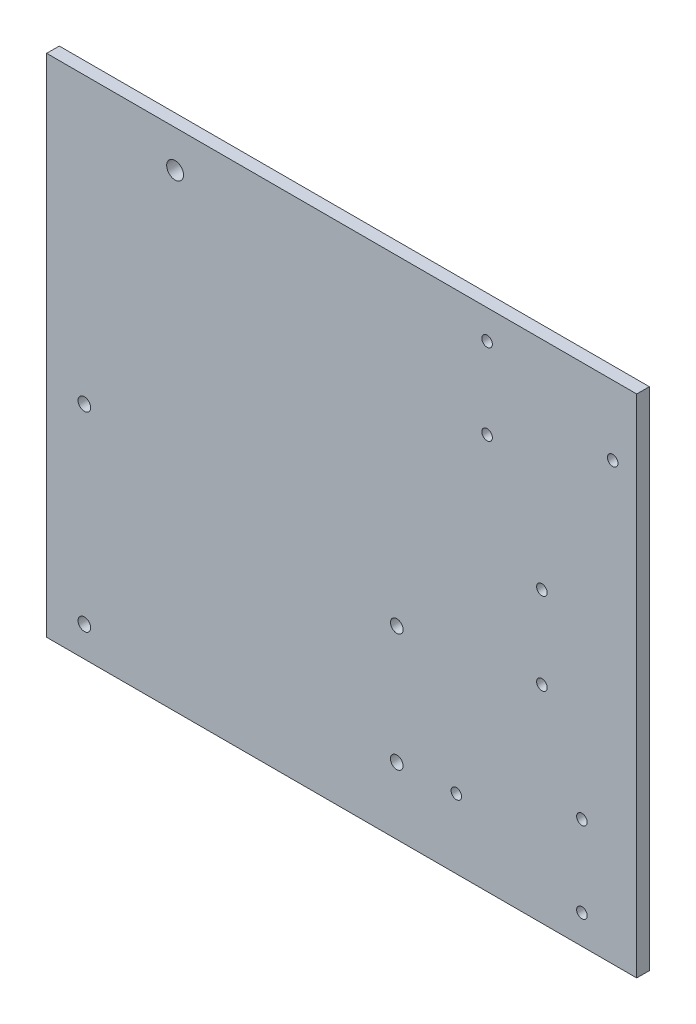
ISO-10303-21;
HEADER;
FILE_DESCRIPTION(('STEP AP214'),'2;1');
FILE_NAME('part.step','',(''),(''),'','','');
FILE_SCHEMA(('AUTOMOTIVE_DESIGN { 1 0 10303 214 1 1 1 1 }'));
ENDSEC;
DATA;
#1=APPLICATION_CONTEXT('core data for automotive mechanical design processes');
#2=APPLICATION_PROTOCOL_DEFINITION('international standard','automotive_design',2000,#1);
#3=PRODUCT_CONTEXT('',#1,'mechanical');
#4=PRODUCT('Part','Part','',(#3));
#5=PRODUCT_RELATED_PRODUCT_CATEGORY('part','',(#4));
#6=PRODUCT_DEFINITION_FORMATION('','',#4);
#7=PRODUCT_DEFINITION_CONTEXT('part definition',#1,'design');
#8=PRODUCT_DEFINITION('design','',#6,#7);
#9=PRODUCT_DEFINITION_SHAPE('','',#8);
#10=(LENGTH_UNIT() NAMED_UNIT(*) SI_UNIT(.MILLI.,.METRE.));
#11=(NAMED_UNIT(*) PLANE_ANGLE_UNIT() SI_UNIT($,.RADIAN.));
#12=(NAMED_UNIT(*) SI_UNIT($,.STERADIAN.) SOLID_ANGLE_UNIT());
#13=UNCERTAINTY_MEASURE_WITH_UNIT(LENGTH_MEASURE(1.E-05),#10,'distance_accuracy_value','');
#14=(GEOMETRIC_REPRESENTATION_CONTEXT(3) GLOBAL_UNCERTAINTY_ASSIGNED_CONTEXT((#13)) GLOBAL_UNIT_ASSIGNED_CONTEXT((#10,
#11,#12)) REPRESENTATION_CONTEXT('',''));
#15=CARTESIAN_POINT('',(0.,0.,0.));
#16=DIRECTION('',(0.,0.,1.));
#17=DIRECTION('',(1.,0.,0.));
#18=AXIS2_PLACEMENT_3D('',#15,#16,#17);
#19=CARTESIAN_POINT('',(0.,0.,3.));
#20=DIRECTION('',(0.,0.,1.));
#21=DIRECTION('',(1.,0.,0.));
#22=AXIS2_PLACEMENT_3D('',#19,#20,#21);
#23=PLANE('',#22);
#24=CARTESIAN_POINT('',(-42.8,16.5,3.));
#25=DIRECTION('',(0.,0.,1.));
#26=DIRECTION('',(-1.,0.,0.));
#27=AXIS2_PLACEMENT_3D('',#24,#25,#26);
#28=CIRCLE('',#27,1.25);
#29=CARTESIAN_POINT('',(-44.05,16.5,3.));
#30=VERTEX_POINT('',#29);
#31=EDGE_CURVE('E175',#30,#30,#28,.T.);
#32=ORIENTED_EDGE('',*,*,#31,.F.);
#33=EDGE_LOOP('',(#32));
#34=FACE_BOUND('',#33,.T.);
#35=CARTESIAN_POINT('',(-13.,26.11,3.));
#36=DIRECTION('',(0.,0.,1.));
#37=DIRECTION('',(-1.,0.,0.));
#38=AXIS2_PLACEMENT_3D('',#35,#36,#37);
#39=CIRCLE('',#38,1.25);
#40=CARTESIAN_POINT('',(-14.25,26.11,3.));
#41=VERTEX_POINT('',#40);
#42=EDGE_CURVE('E163',#41,#41,#39,.T.);
#43=ORIENTED_EDGE('',*,*,#42,.F.);
#44=EDGE_LOOP('',(#43));
#45=FACE_BOUND('',#44,.T.);
#46=CARTESIAN_POINT('',(-5.7,103.5,3.));
#47=DIRECTION('',(0.,0.,1.));
#48=DIRECTION('',(-1.,0.,0.));
#49=AXIS2_PLACEMENT_3D('',#46,#47,#48);
#50=CIRCLE('',#49,1.25000000000001);
#51=CARTESIAN_POINT('',(-6.95000000000001,103.5,3.));
#52=VERTEX_POINT('',#51);
#53=EDGE_CURVE('E151',#52,#52,#50,.T.);
#54=ORIENTED_EDGE('',*,*,#53,.F.);
#55=EDGE_LOOP('',(#54));
#56=FACE_BOUND('',#55,.T.);
#57=CARTESIAN_POINT('',(-35.5,113.09,3.));
#58=DIRECTION('',(0.,0.,1.));
#59=DIRECTION('',(-1.,0.,0.));
#60=AXIS2_PLACEMENT_3D('',#57,#58,#59);
#61=CIRCLE('',#60,1.25);
#62=CARTESIAN_POINT('',(-36.75,113.09,3.));
#63=VERTEX_POINT('',#62);
#64=EDGE_CURVE('E139',#63,#63,#61,.T.);
#65=ORIENTED_EDGE('',*,*,#64,.F.);
#66=EDGE_LOOP('',(#65));
#67=FACE_BOUND('',#66,.T.);
#68=CARTESIAN_POINT('',(-35.5,93.89,3.));
#69=DIRECTION('',(0.,0.,1.));
#70=DIRECTION('',(-1.,0.,0.));
#71=AXIS2_PLACEMENT_3D('',#68,#69,#70);
#72=CIRCLE('',#71,1.25);
#73=CARTESIAN_POINT('',(-36.75,93.89,3.));
#74=VERTEX_POINT('',#73);
#75=EDGE_CURVE('E127',#74,#74,#72,.T.);
#76=ORIENTED_EDGE('',*,*,#75,.F.);
#77=EDGE_LOOP('',(#76));
#78=FACE_BOUND('',#77,.T.);
#79=CARTESIAN_POINT('',(-131.05,52.4100000000001,3.));
#80=DIRECTION('',(0.,0.,1.));
#81=DIRECTION('',(-1.,0.,0.));
#82=AXIS2_PLACEMENT_3D('',#79,#80,#81);
#83=CIRCLE('',#82,1.5);
#84=CARTESIAN_POINT('',(-132.55,52.4100000000001,3.));
#85=VERTEX_POINT('',#84);
#86=EDGE_CURVE('E115',#85,#85,#83,.T.);
#87=ORIENTED_EDGE('',*,*,#86,.F.);
#88=EDGE_LOOP('',(#87));
#89=FACE_BOUND('',#88,.T.);
#90=DIRECTION('',(0.,1.,0.));
#91=VECTOR('',#90,1.);
#92=CARTESIAN_POINT('',(0.,0.,3.));
#93=LINE('',#92,#91);
#94=CARTESIAN_POINT('',(0.,0.,3.));
#95=VERTEX_POINT('',#94);
#96=CARTESIAN_POINT('',(0.,120.,3.));
#97=VERTEX_POINT('',#96);
#98=EDGE_CURVE('E85',#95,#97,#93,.T.);
#99=ORIENTED_EDGE('',*,*,#98,.T.);
#100=DIRECTION('',(-1.,0.,0.));
#101=VECTOR('',#100,1.);
#102=CARTESIAN_POINT('',(0.,120.,3.));
#103=LINE('',#102,#101);
#104=CARTESIAN_POINT('',(-140.,120.,3.));
#105=VERTEX_POINT('',#104);
#106=EDGE_CURVE('E80',#97,#105,#103,.T.);
#107=ORIENTED_EDGE('',*,*,#106,.T.);
#108=DIRECTION('',(0.,-1.,0.));
#109=VECTOR('',#108,1.);
#110=CARTESIAN_POINT('',(-140.,0.,3.));
#111=LINE('',#110,#109);
#112=CARTESIAN_POINT('',(-140.,0.,3.));
#113=VERTEX_POINT('',#112);
#114=EDGE_CURVE('E83',#105,#113,#111,.T.);
#115=ORIENTED_EDGE('',*,*,#114,.T.);
#116=DIRECTION('',(1.,0.,0.));
#117=VECTOR('',#116,1.);
#118=CARTESIAN_POINT('',(0.,0.,3.));
#119=LINE('',#118,#117);
#120=EDGE_CURVE('E50',#113,#95,#119,.T.);
#121=ORIENTED_EDGE('',*,*,#120,.T.);
#122=EDGE_LOOP('',(#99,#107,#115,#121));
#123=FACE_BOUND('',#122,.T.);
#124=CARTESIAN_POINT('',(-109.522973193563,111.205068666322,3.));
#125=DIRECTION('',(0.,0.,1.));
#126=DIRECTION('',(1.,0.,0.));
#127=AXIS2_PLACEMENT_3D('',#124,#125,#126);
#128=CIRCLE('',#127,2.);
#129=CARTESIAN_POINT('',(-107.522973193563,111.205068666322,3.));
#130=VERTEX_POINT('',#129);
#131=EDGE_CURVE('E100',#130,#130,#128,.T.);
#132=ORIENTED_EDGE('',*,*,#131,.F.);
#133=EDGE_LOOP('',(#132));
#134=FACE_BOUND('',#133,.T.);
#135=CARTESIAN_POINT('',(-131.05,7.17000000000005,3.));
#136=DIRECTION('',(0.,0.,1.));
#137=DIRECTION('',(-1.,0.,0.));
#138=AXIS2_PLACEMENT_3D('',#135,#136,#137);
#139=CIRCLE('',#138,1.5);
#140=CARTESIAN_POINT('',(-132.55,7.17000000000005,3.));
#141=VERTEX_POINT('',#140);
#142=EDGE_CURVE('E121',#141,#141,#139,.T.);
#143=ORIENTED_EDGE('',*,*,#142,.F.);
#144=EDGE_LOOP('',(#143));
#145=FACE_BOUND('',#144,.T.);
#146=CARTESIAN_POINT('',(-56.93,15.86,3.));
#147=DIRECTION('',(0.,0.,1.));
#148=DIRECTION('',(-1.,0.,0.));
#149=AXIS2_PLACEMENT_3D('',#146,#147,#148);
#150=CIRCLE('',#149,1.5);
#151=CARTESIAN_POINT('',(-58.43,15.86,3.));
#152=VERTEX_POINT('',#151);
#153=EDGE_CURVE('E133',#152,#152,#150,.T.);
#154=ORIENTED_EDGE('',*,*,#153,.F.);
#155=EDGE_LOOP('',(#154));
#156=FACE_BOUND('',#155,.T.);
#157=CARTESIAN_POINT('',(-56.93,43.86,3.));
#158=DIRECTION('',(0.,0.,1.));
#159=DIRECTION('',(-1.,0.,0.));
#160=AXIS2_PLACEMENT_3D('',#157,#158,#159);
#161=CIRCLE('',#160,1.5);
#162=CARTESIAN_POINT('',(-58.43,43.86,3.));
#163=VERTEX_POINT('',#162);
#164=EDGE_CURVE('E145',#163,#163,#161,.T.);
#165=ORIENTED_EDGE('',*,*,#164,.F.);
#166=EDGE_LOOP('',(#165));
#167=FACE_BOUND('',#166,.T.);
#168=CARTESIAN_POINT('',(-13.,6.91,3.));
#169=DIRECTION('',(0.,0.,1.));
#170=DIRECTION('',(-1.,0.,0.));
#171=AXIS2_PLACEMENT_3D('',#168,#169,#170);
#172=CIRCLE('',#171,1.25);
#173=CARTESIAN_POINT('',(-14.25,6.91,3.));
#174=VERTEX_POINT('',#173);
#175=EDGE_CURVE('E157',#174,#174,#172,.T.);
#176=ORIENTED_EDGE('',*,*,#175,.F.);
#177=EDGE_LOOP('',(#176));
#178=FACE_BOUND('',#177,.T.);
#179=CARTESIAN_POINT('',(-22.5,49.0276262940552,3.));
#180=DIRECTION('',(0.,0.,1.));
#181=DIRECTION('',(1.,0.,0.));
#182=AXIS2_PLACEMENT_3D('',#179,#180,#181);
#183=CIRCLE('',#182,1.25);
#184=CARTESIAN_POINT('',(-21.25,49.0276262940552,3.));
#185=VERTEX_POINT('',#184);
#186=EDGE_CURVE('E169',#185,#185,#183,.T.);
#187=ORIENTED_EDGE('',*,*,#186,.F.);
#188=EDGE_LOOP('',(#187));
#189=FACE_BOUND('',#188,.T.);
#190=CARTESIAN_POINT('',(-22.5,68.5276262940552,3.));
#191=DIRECTION('',(0.,0.,1.));
#192=DIRECTION('',(1.,0.,0.));
#193=AXIS2_PLACEMENT_3D('',#190,#191,#192);
#194=CIRCLE('',#193,1.25);
#195=CARTESIAN_POINT('',(-21.25,68.5276262940552,3.));
#196=VERTEX_POINT('',#195);
#197=EDGE_CURVE('E181',#196,#196,#194,.T.);
#198=ORIENTED_EDGE('',*,*,#197,.F.);
#199=EDGE_LOOP('',(#198));
#200=FACE_BOUND('',#199,.T.);
#201=ADVANCED_FACE('F33',(#34,#45,#56,#67,#78,#89,#123,#134,#145,#156,#167,#178,#189,#200),#23,.T.);
#202=CARTESIAN_POINT('',(0.,0.,0.));
#203=DIRECTION('',(0.,0.,1.));
#204=DIRECTION('',(1.,0.,0.));
#205=AXIS2_PLACEMENT_3D('',#202,#203,#204);
#206=PLANE('',#205);
#207=DIRECTION('',(0.,1.,0.));
#208=VECTOR('',#207,1.);
#209=CARTESIAN_POINT('',(0.,0.,0.));
#210=LINE('',#209,#208);
#211=CARTESIAN_POINT('',(0.,0.,0.));
#212=VERTEX_POINT('',#211);
#213=CARTESIAN_POINT('',(0.,120.,0.));
#214=VERTEX_POINT('',#213);
#215=EDGE_CURVE('E97',#212,#214,#210,.T.);
#216=ORIENTED_EDGE('',*,*,#215,.F.);
#217=DIRECTION('',(1.,0.,0.));
#218=VECTOR('',#217,1.);
#219=CARTESIAN_POINT('',(0.,0.,0.));
#220=LINE('',#219,#218);
#221=CARTESIAN_POINT('',(-140.,0.,0.));
#222=VERTEX_POINT('',#221);
#223=EDGE_CURVE('E73',#222,#212,#220,.T.);
#224=ORIENTED_EDGE('',*,*,#223,.F.);
#225=DIRECTION('',(0.,-1.,0.));
#226=VECTOR('',#225,1.);
#227=CARTESIAN_POINT('',(-140.,0.,0.));
#228=LINE('',#227,#226);
#229=CARTESIAN_POINT('',(-140.,120.,0.));
#230=VERTEX_POINT('',#229);
#231=EDGE_CURVE('E67',#230,#222,#228,.T.);
#232=ORIENTED_EDGE('',*,*,#231,.F.);
#233=DIRECTION('',(-1.,0.,0.));
#234=VECTOR('',#233,1.);
#235=CARTESIAN_POINT('',(0.,120.,0.));
#236=LINE('',#235,#234);
#237=EDGE_CURVE('E89',#214,#230,#236,.T.);
#238=ORIENTED_EDGE('',*,*,#237,.F.);
#239=EDGE_LOOP('',(#216,#224,#232,#238));
#240=FACE_BOUND('',#239,.T.);
#241=CARTESIAN_POINT('',(-109.522973193563,111.205068666322,0.));
#242=DIRECTION('',(0.,0.,1.));
#243=DIRECTION('',(1.,0.,0.));
#244=AXIS2_PLACEMENT_3D('',#241,#242,#243);
#245=CIRCLE('',#244,2.);
#246=CARTESIAN_POINT('',(-107.522973193563,111.205068666322,0.));
#247=VERTEX_POINT('',#246);
#248=EDGE_CURVE('E112',#247,#247,#245,.T.);
#249=ORIENTED_EDGE('',*,*,#248,.T.);
#250=EDGE_LOOP('',(#249));
#251=FACE_BOUND('',#250,.T.);
#252=CARTESIAN_POINT('',(-131.05,52.4100000000001,0.));
#253=DIRECTION('',(0.,0.,1.));
#254=DIRECTION('',(-1.,0.,0.));
#255=AXIS2_PLACEMENT_3D('',#252,#253,#254);
#256=CIRCLE('',#255,1.5);
#257=CARTESIAN_POINT('',(-132.55,52.4100000000001,0.));
#258=VERTEX_POINT('',#257);
#259=EDGE_CURVE('E118',#258,#258,#256,.T.);
#260=ORIENTED_EDGE('',*,*,#259,.T.);
#261=EDGE_LOOP('',(#260));
#262=FACE_BOUND('',#261,.T.);
#263=CARTESIAN_POINT('',(-131.05,7.17000000000005,0.));
#264=DIRECTION('',(0.,0.,1.));
#265=DIRECTION('',(-1.,0.,0.));
#266=AXIS2_PLACEMENT_3D('',#263,#264,#265);
#267=CIRCLE('',#266,1.5);
#268=CARTESIAN_POINT('',(-132.55,7.17000000000005,0.));
#269=VERTEX_POINT('',#268);
#270=EDGE_CURVE('E124',#269,#269,#267,.T.);
#271=ORIENTED_EDGE('',*,*,#270,.T.);
#272=EDGE_LOOP('',(#271));
#273=FACE_BOUND('',#272,.T.);
#274=CARTESIAN_POINT('',(-35.5,93.89,0.));
#275=DIRECTION('',(0.,0.,1.));
#276=DIRECTION('',(-1.,0.,0.));
#277=AXIS2_PLACEMENT_3D('',#274,#275,#276);
#278=CIRCLE('',#277,1.25);
#279=CARTESIAN_POINT('',(-36.75,93.89,0.));
#280=VERTEX_POINT('',#279);
#281=EDGE_CURVE('E130',#280,#280,#278,.T.);
#282=ORIENTED_EDGE('',*,*,#281,.T.);
#283=EDGE_LOOP('',(#282));
#284=FACE_BOUND('',#283,.T.);
#285=CARTESIAN_POINT('',(-56.93,15.86,0.));
#286=DIRECTION('',(0.,0.,1.));
#287=DIRECTION('',(-1.,0.,0.));
#288=AXIS2_PLACEMENT_3D('',#285,#286,#287);
#289=CIRCLE('',#288,1.5);
#290=CARTESIAN_POINT('',(-58.43,15.86,0.));
#291=VERTEX_POINT('',#290);
#292=EDGE_CURVE('E136',#291,#291,#289,.T.);
#293=ORIENTED_EDGE('',*,*,#292,.T.);
#294=EDGE_LOOP('',(#293));
#295=FACE_BOUND('',#294,.T.);
#296=CARTESIAN_POINT('',(-35.5,113.09,0.));
#297=DIRECTION('',(0.,0.,1.));
#298=DIRECTION('',(-1.,0.,0.));
#299=AXIS2_PLACEMENT_3D('',#296,#297,#298);
#300=CIRCLE('',#299,1.25);
#301=CARTESIAN_POINT('',(-36.75,113.09,0.));
#302=VERTEX_POINT('',#301);
#303=EDGE_CURVE('E142',#302,#302,#300,.T.);
#304=ORIENTED_EDGE('',*,*,#303,.T.);
#305=EDGE_LOOP('',(#304));
#306=FACE_BOUND('',#305,.T.);
#307=CARTESIAN_POINT('',(-56.93,43.86,0.));
#308=DIRECTION('',(0.,0.,1.));
#309=DIRECTION('',(-1.,0.,0.));
#310=AXIS2_PLACEMENT_3D('',#307,#308,#309);
#311=CIRCLE('',#310,1.5);
#312=CARTESIAN_POINT('',(-58.43,43.86,0.));
#313=VERTEX_POINT('',#312);
#314=EDGE_CURVE('E148',#313,#313,#311,.T.);
#315=ORIENTED_EDGE('',*,*,#314,.T.);
#316=EDGE_LOOP('',(#315));
#317=FACE_BOUND('',#316,.T.);
#318=CARTESIAN_POINT('',(-5.7,103.5,0.));
#319=DIRECTION('',(0.,0.,1.));
#320=DIRECTION('',(-1.,0.,0.));
#321=AXIS2_PLACEMENT_3D('',#318,#319,#320);
#322=CIRCLE('',#321,1.25000000000001);
#323=CARTESIAN_POINT('',(-6.95000000000001,103.5,0.));
#324=VERTEX_POINT('',#323);
#325=EDGE_CURVE('E154',#324,#324,#322,.T.);
#326=ORIENTED_EDGE('',*,*,#325,.T.);
#327=EDGE_LOOP('',(#326));
#328=FACE_BOUND('',#327,.T.);
#329=CARTESIAN_POINT('',(-13.,6.91,0.));
#330=DIRECTION('',(0.,0.,1.));
#331=DIRECTION('',(-1.,0.,0.));
#332=AXIS2_PLACEMENT_3D('',#329,#330,#331);
#333=CIRCLE('',#332,1.25);
#334=CARTESIAN_POINT('',(-14.25,6.91,0.));
#335=VERTEX_POINT('',#334);
#336=EDGE_CURVE('E160',#335,#335,#333,.T.);
#337=ORIENTED_EDGE('',*,*,#336,.T.);
#338=EDGE_LOOP('',(#337));
#339=FACE_BOUND('',#338,.T.);
#340=CARTESIAN_POINT('',(-13.,26.11,0.));
#341=DIRECTION('',(0.,0.,1.));
#342=DIRECTION('',(-1.,0.,0.));
#343=AXIS2_PLACEMENT_3D('',#340,#341,#342);
#344=CIRCLE('',#343,1.25);
#345=CARTESIAN_POINT('',(-14.25,26.11,0.));
#346=VERTEX_POINT('',#345);
#347=EDGE_CURVE('E166',#346,#346,#344,.T.);
#348=ORIENTED_EDGE('',*,*,#347,.T.);
#349=EDGE_LOOP('',(#348));
#350=FACE_BOUND('',#349,.T.);
#351=CARTESIAN_POINT('',(-22.5,49.0276262940552,0.));
#352=DIRECTION('',(0.,0.,1.));
#353=DIRECTION('',(1.,0.,0.));
#354=AXIS2_PLACEMENT_3D('',#351,#352,#353);
#355=CIRCLE('',#354,1.25);
#356=CARTESIAN_POINT('',(-21.25,49.0276262940552,0.));
#357=VERTEX_POINT('',#356);
#358=EDGE_CURVE('E172',#357,#357,#355,.T.);
#359=ORIENTED_EDGE('',*,*,#358,.T.);
#360=EDGE_LOOP('',(#359));
#361=FACE_BOUND('',#360,.T.);
#362=CARTESIAN_POINT('',(-42.8,16.5,0.));
#363=DIRECTION('',(0.,0.,1.));
#364=DIRECTION('',(-1.,0.,0.));
#365=AXIS2_PLACEMENT_3D('',#362,#363,#364);
#366=CIRCLE('',#365,1.25);
#367=CARTESIAN_POINT('',(-44.05,16.5,0.));
#368=VERTEX_POINT('',#367);
#369=EDGE_CURVE('E178',#368,#368,#366,.T.);
#370=ORIENTED_EDGE('',*,*,#369,.T.);
#371=EDGE_LOOP('',(#370));
#372=FACE_BOUND('',#371,.T.);
#373=CARTESIAN_POINT('',(-22.5,68.5276262940552,0.));
#374=DIRECTION('',(0.,0.,1.));
#375=DIRECTION('',(1.,0.,0.));
#376=AXIS2_PLACEMENT_3D('',#373,#374,#375);
#377=CIRCLE('',#376,1.25);
#378=CARTESIAN_POINT('',(-21.25,68.5276262940552,0.));
#379=VERTEX_POINT('',#378);
#380=EDGE_CURVE('E184',#379,#379,#377,.T.);
#381=ORIENTED_EDGE('',*,*,#380,.T.);
#382=EDGE_LOOP('',(#381));
#383=FACE_BOUND('',#382,.T.);
#384=ADVANCED_FACE('F108',(#240,#251,#262,#273,#284,#295,#306,#317,#328,#339,#350,#361,#372,
#383),#206,.F.);
#385=CARTESIAN_POINT('',(0.,0.,3.));
#386=DIRECTION('',(-1.,0.,0.));
#387=DIRECTION('',(0.,0.,1.));
#388=AXIS2_PLACEMENT_3D('',#385,#386,#387);
#389=PLANE('',#388);
#390=ORIENTED_EDGE('',*,*,#215,.T.);
#391=DIRECTION('',(0.,0.,-1.));
#392=VECTOR('',#391,1.);
#393=CARTESIAN_POINT('',(0.,120.,3.));
#394=LINE('',#393,#392);
#395=EDGE_CURVE('E11',#97,#214,#394,.T.);
#396=ORIENTED_EDGE('',*,*,#395,.F.);
#397=ORIENTED_EDGE('',*,*,#98,.F.);
#398=DIRECTION('',(0.,0.,-1.));
#399=VECTOR('',#398,1.);
#400=CARTESIAN_POINT('',(0.,0.,3.));
#401=LINE('',#400,#399);
#402=EDGE_CURVE('E93',#95,#212,#401,.T.);
#403=ORIENTED_EDGE('',*,*,#402,.T.);
#404=EDGE_LOOP('',(#390,#396,#397,#403));
#405=FACE_BOUND('',#404,.T.);
#406=ADVANCED_FACE('F35',(#405),#389,.F.);
#407=CARTESIAN_POINT('',(0.,120.,3.));
#408=DIRECTION('',(0.,-1.,0.));
#409=DIRECTION('',(1.,0.,0.));
#410=AXIS2_PLACEMENT_3D('',#407,#408,#409);
#411=PLANE('',#410);
#412=ORIENTED_EDGE('',*,*,#237,.T.);
#413=DIRECTION('',(0.,0.,-1.));
#414=VECTOR('',#413,1.);
#415=CARTESIAN_POINT('',(-140.,120.,3.));
#416=LINE('',#415,#414);
#417=EDGE_CURVE('E42',#105,#230,#416,.T.);
#418=ORIENTED_EDGE('',*,*,#417,.F.);
#419=ORIENTED_EDGE('',*,*,#106,.F.);
#420=ORIENTED_EDGE('',*,*,#395,.T.);
#421=EDGE_LOOP('',(#412,#418,#419,#420));
#422=FACE_BOUND('',#421,.T.);
#423=ADVANCED_FACE('F88',(#422),#411,.F.);
#424=CARTESIAN_POINT('',(-140.,0.,3.));
#425=DIRECTION('',(1.,0.,0.));
#426=DIRECTION('',(0.,0.,-1.));
#427=AXIS2_PLACEMENT_3D('',#424,#425,#426);
#428=PLANE('',#427);
#429=ORIENTED_EDGE('',*,*,#231,.T.);
#430=DIRECTION('',(0.,0.,-1.));
#431=VECTOR('',#430,1.);
#432=CARTESIAN_POINT('',(-140.,0.,3.));
#433=LINE('',#432,#431);
#434=EDGE_CURVE('E90',#113,#222,#433,.T.);
#435=ORIENTED_EDGE('',*,*,#434,.F.);
#436=ORIENTED_EDGE('',*,*,#114,.F.);
#437=ORIENTED_EDGE('',*,*,#417,.T.);
#438=EDGE_LOOP('',(#429,#435,#436,#437));
#439=FACE_BOUND('',#438,.T.);
#440=ADVANCED_FACE('F91',(#439),#428,.F.);
#441=CARTESIAN_POINT('',(0.,0.,3.));
#442=DIRECTION('',(0.,1.,0.));
#443=DIRECTION('',(-1.,0.,0.));
#444=AXIS2_PLACEMENT_3D('',#441,#442,#443);
#445=PLANE('',#444);
#446=ORIENTED_EDGE('',*,*,#223,.T.);
#447=ORIENTED_EDGE('',*,*,#402,.F.);
#448=ORIENTED_EDGE('',*,*,#120,.F.);
#449=ORIENTED_EDGE('',*,*,#434,.T.);
#450=EDGE_LOOP('',(#446,#447,#448,#449));
#451=FACE_BOUND('',#450,.T.);
#452=ADVANCED_FACE('F105',(#451),#445,.F.);
#453=CARTESIAN_POINT('',(-109.522973193563,111.205068666322,3.));
#454=DIRECTION('',(0.,0.,-1.));
#455=DIRECTION('',(-1.,0.,0.));
#456=AXIS2_PLACEMENT_3D('',#453,#454,#455);
#457=CYLINDRICAL_SURFACE('',#456,2.);
#458=ORIENTED_EDGE('',*,*,#131,.T.);
#459=EDGE_LOOP('',(#458));
#460=FACE_BOUND('',#459,.T.);
#461=ORIENTED_EDGE('',*,*,#248,.F.);
#462=EDGE_LOOP('',(#461));
#463=FACE_BOUND('',#462,.T.);
#464=ADVANCED_FACE('F203',(#460,#463),#457,.F.);
#465=CARTESIAN_POINT('',(-131.05,52.4100000000001,3.));
#466=DIRECTION('',(0.,0.,-1.));
#467=DIRECTION('',(-1.,0.,0.));
#468=AXIS2_PLACEMENT_3D('',#465,#466,#467);
#469=CYLINDRICAL_SURFACE('',#468,1.5);
#470=ORIENTED_EDGE('',*,*,#86,.T.);
#471=EDGE_LOOP('',(#470));
#472=FACE_BOUND('',#471,.T.);
#473=ORIENTED_EDGE('',*,*,#259,.F.);
#474=EDGE_LOOP('',(#473));
#475=FACE_BOUND('',#474,.T.);
#476=ADVANCED_FACE('F249',(#472,#475),#469,.F.);
#477=CARTESIAN_POINT('',(-131.05,7.17000000000005,3.));
#478=DIRECTION('',(0.,0.,-1.));
#479=DIRECTION('',(-1.,0.,0.));
#480=AXIS2_PLACEMENT_3D('',#477,#478,#479);
#481=CYLINDRICAL_SURFACE('',#480,1.5);
#482=ORIENTED_EDGE('',*,*,#142,.T.);
#483=EDGE_LOOP('',(#482));
#484=FACE_BOUND('',#483,.T.);
#485=ORIENTED_EDGE('',*,*,#270,.F.);
#486=EDGE_LOOP('',(#485));
#487=FACE_BOUND('',#486,.T.);
#488=ADVANCED_FACE('F257',(#484,#487),#481,.F.);
#489=CARTESIAN_POINT('',(-35.5,93.89,3.));
#490=DIRECTION('',(0.,0.,-1.));
#491=DIRECTION('',(-1.,0.,0.));
#492=AXIS2_PLACEMENT_3D('',#489,#490,#491);
#493=CYLINDRICAL_SURFACE('',#492,1.25);
#494=ORIENTED_EDGE('',*,*,#75,.T.);
#495=EDGE_LOOP('',(#494));
#496=FACE_BOUND('',#495,.T.);
#497=ORIENTED_EDGE('',*,*,#281,.F.);
#498=EDGE_LOOP('',(#497));
#499=FACE_BOUND('',#498,.T.);
#500=ADVANCED_FACE('F265',(#496,#499),#493,.F.);
#501=CARTESIAN_POINT('',(-56.93,15.86,3.));
#502=DIRECTION('',(0.,0.,-1.));
#503=DIRECTION('',(-1.,0.,0.));
#504=AXIS2_PLACEMENT_3D('',#501,#502,#503);
#505=CYLINDRICAL_SURFACE('',#504,1.5);
#506=ORIENTED_EDGE('',*,*,#153,.T.);
#507=EDGE_LOOP('',(#506));
#508=FACE_BOUND('',#507,.T.);
#509=ORIENTED_EDGE('',*,*,#292,.F.);
#510=EDGE_LOOP('',(#509));
#511=FACE_BOUND('',#510,.T.);
#512=ADVANCED_FACE('F274',(#508,#511),#505,.F.);
#513=CARTESIAN_POINT('',(-35.5,113.09,3.));
#514=DIRECTION('',(0.,0.,-1.));
#515=DIRECTION('',(-1.,0.,0.));
#516=AXIS2_PLACEMENT_3D('',#513,#514,#515);
#517=CYLINDRICAL_SURFACE('',#516,1.25);
#518=ORIENTED_EDGE('',*,*,#64,.T.);
#519=EDGE_LOOP('',(#518));
#520=FACE_BOUND('',#519,.T.);
#521=ORIENTED_EDGE('',*,*,#303,.F.);
#522=EDGE_LOOP('',(#521));
#523=FACE_BOUND('',#522,.T.);
#524=ADVANCED_FACE('F283',(#520,#523),#517,.F.);
#525=CARTESIAN_POINT('',(-56.93,43.86,3.));
#526=DIRECTION('',(0.,0.,-1.));
#527=DIRECTION('',(-1.,0.,0.));
#528=AXIS2_PLACEMENT_3D('',#525,#526,#527);
#529=CYLINDRICAL_SURFACE('',#528,1.5);
#530=ORIENTED_EDGE('',*,*,#164,.T.);
#531=EDGE_LOOP('',(#530));
#532=FACE_BOUND('',#531,.T.);
#533=ORIENTED_EDGE('',*,*,#314,.F.);
#534=EDGE_LOOP('',(#533));
#535=FACE_BOUND('',#534,.T.);
#536=ADVANCED_FACE('F292',(#532,#535),#529,.F.);
#537=CARTESIAN_POINT('',(-5.7,103.5,3.));
#538=DIRECTION('',(0.,0.,-1.));
#539=DIRECTION('',(-1.,0.,0.));
#540=AXIS2_PLACEMENT_3D('',#537,#538,#539);
#541=CYLINDRICAL_SURFACE('',#540,1.25000000000001);
#542=ORIENTED_EDGE('',*,*,#53,.T.);
#543=EDGE_LOOP('',(#542));
#544=FACE_BOUND('',#543,.T.);
#545=ORIENTED_EDGE('',*,*,#325,.F.);
#546=EDGE_LOOP('',(#545));
#547=FACE_BOUND('',#546,.T.);
#548=ADVANCED_FACE('F301',(#544,#547),#541,.F.);
#549=CARTESIAN_POINT('',(-13.,6.91,3.));
#550=DIRECTION('',(0.,0.,-1.));
#551=DIRECTION('',(-1.,0.,0.));
#552=AXIS2_PLACEMENT_3D('',#549,#550,#551);
#553=CYLINDRICAL_SURFACE('',#552,1.25);
#554=ORIENTED_EDGE('',*,*,#175,.T.);
#555=EDGE_LOOP('',(#554));
#556=FACE_BOUND('',#555,.T.);
#557=ORIENTED_EDGE('',*,*,#336,.F.);
#558=EDGE_LOOP('',(#557));
#559=FACE_BOUND('',#558,.T.);
#560=ADVANCED_FACE('F310',(#556,#559),#553,.F.);
#561=CARTESIAN_POINT('',(-13.,26.11,3.));
#562=DIRECTION('',(0.,0.,-1.));
#563=DIRECTION('',(-1.,0.,0.));
#564=AXIS2_PLACEMENT_3D('',#561,#562,#563);
#565=CYLINDRICAL_SURFACE('',#564,1.25);
#566=ORIENTED_EDGE('',*,*,#42,.T.);
#567=EDGE_LOOP('',(#566));
#568=FACE_BOUND('',#567,.T.);
#569=ORIENTED_EDGE('',*,*,#347,.F.);
#570=EDGE_LOOP('',(#569));
#571=FACE_BOUND('',#570,.T.);
#572=ADVANCED_FACE('F319',(#568,#571),#565,.F.);
#573=CARTESIAN_POINT('',(-22.5,49.0276262940552,3.));
#574=DIRECTION('',(0.,0.,-1.));
#575=DIRECTION('',(-1.,0.,0.));
#576=AXIS2_PLACEMENT_3D('',#573,#574,#575);
#577=CYLINDRICAL_SURFACE('',#576,1.25);
#578=ORIENTED_EDGE('',*,*,#186,.T.);
#579=EDGE_LOOP('',(#578));
#580=FACE_BOUND('',#579,.T.);
#581=ORIENTED_EDGE('',*,*,#358,.F.);
#582=EDGE_LOOP('',(#581));
#583=FACE_BOUND('',#582,.T.);
#584=ADVANCED_FACE('F328',(#580,#583),#577,.F.);
#585=CARTESIAN_POINT('',(-42.8,16.5,3.));
#586=DIRECTION('',(0.,0.,-1.));
#587=DIRECTION('',(-1.,0.,0.));
#588=AXIS2_PLACEMENT_3D('',#585,#586,#587);
#589=CYLINDRICAL_SURFACE('',#588,1.25);
#590=ORIENTED_EDGE('',*,*,#31,.T.);
#591=EDGE_LOOP('',(#590));
#592=FACE_BOUND('',#591,.T.);
#593=ORIENTED_EDGE('',*,*,#369,.F.);
#594=EDGE_LOOP('',(#593));
#595=FACE_BOUND('',#594,.T.);
#596=ADVANCED_FACE('F337',(#592,#595),#589,.F.);
#597=CARTESIAN_POINT('',(-22.5,68.5276262940552,3.));
#598=DIRECTION('',(0.,0.,-1.));
#599=DIRECTION('',(-1.,0.,0.));
#600=AXIS2_PLACEMENT_3D('',#597,#598,#599);
#601=CYLINDRICAL_SURFACE('',#600,1.25);
#602=ORIENTED_EDGE('',*,*,#197,.T.);
#603=EDGE_LOOP('',(#602));
#604=FACE_BOUND('',#603,.T.);
#605=ORIENTED_EDGE('',*,*,#380,.F.);
#606=EDGE_LOOP('',(#605));
#607=FACE_BOUND('',#606,.T.);
#608=ADVANCED_FACE('F190',(#604,#607),#601,.F.);
#609=CLOSED_SHELL('',(#201,#384,#406,#423,#440,#452,#464,#476,#488,#500,#512,#524,#536,#548,
#560,#572,#584,#596,#608));
#610=MANIFOLD_SOLID_BREP('B2',#609);
#611=ADVANCED_BREP_SHAPE_REPRESENTATION('',(#18,#610),#14);
#612=SHAPE_DEFINITION_REPRESENTATION(#9,#611);
ENDSEC;
END-ISO-10303-21;
